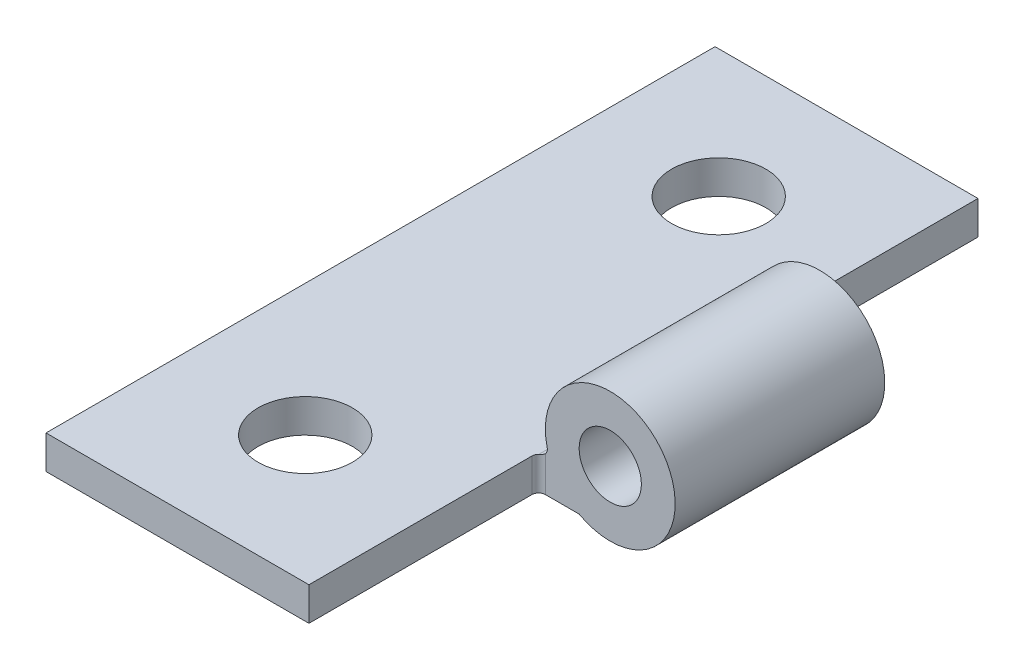
ISO-10303-21;
HEADER;
FILE_DESCRIPTION(('STEP AP214'),'2;1');
FILE_NAME('part.step','',(''),(''),'','','');
FILE_SCHEMA(('AUTOMOTIVE_DESIGN { 1 0 10303 214 1 1 1 1 }'));
ENDSEC;
DATA;
#1=APPLICATION_CONTEXT('core data for automotive mechanical design processes');
#2=APPLICATION_PROTOCOL_DEFINITION('international standard','automotive_design',2000,#1);
#3=PRODUCT_CONTEXT('',#1,'mechanical');
#4=PRODUCT('Part','Part','',(#3));
#5=PRODUCT_RELATED_PRODUCT_CATEGORY('part','',(#4));
#6=PRODUCT_DEFINITION_FORMATION('','',#4);
#7=PRODUCT_DEFINITION_CONTEXT('part definition',#1,'design');
#8=PRODUCT_DEFINITION('design','',#6,#7);
#9=PRODUCT_DEFINITION_SHAPE('','',#8);
#10=(LENGTH_UNIT() NAMED_UNIT(*) SI_UNIT(.MILLI.,.METRE.));
#11=(NAMED_UNIT(*) PLANE_ANGLE_UNIT() SI_UNIT($,.RADIAN.));
#12=(NAMED_UNIT(*) SI_UNIT($,.STERADIAN.) SOLID_ANGLE_UNIT());
#13=UNCERTAINTY_MEASURE_WITH_UNIT(LENGTH_MEASURE(1.E-05),#10,'distance_accuracy_value','');
#14=(GEOMETRIC_REPRESENTATION_CONTEXT(3) GLOBAL_UNCERTAINTY_ASSIGNED_CONTEXT((#13)) GLOBAL_UNIT_ASSIGNED_CONTEXT((#10,
#11,#12)) REPRESENTATION_CONTEXT('',''));
#15=CARTESIAN_POINT('',(0.,0.,0.));
#16=DIRECTION('',(0.,0.,1.));
#17=DIRECTION('',(1.,0.,0.));
#18=AXIS2_PLACEMENT_3D('',#15,#16,#17);
#19=CARTESIAN_POINT('',(-7.56939432776208,4.1385763680781,25.4));
#20=DIRECTION('',(0.,0.,-1.));
#21=DIRECTION('',(-1.,0.,0.));
#22=AXIS2_PLACEMENT_3D('',#19,#20,#21);
#23=CYLINDRICAL_SURFACE('',#22,0.254);
#24=DIRECTION('',(0.,0.,1.));
#25=VECTOR('',#24,1.);
#26=CARTESIAN_POINT('',(-7.56939432776208,3.8845763680781,0.));
#27=LINE('',#26,#25);
#28=CARTESIAN_POINT('',(-7.56939432776208,3.8845763680781,16.7517084015398));
#29=VERTEX_POINT('',#28);
#30=CARTESIAN_POINT('',(-7.56939432776208,3.8845763680781,8.64829159846018));
#31=VERTEX_POINT('',#30);
#32=EDGE_CURVE('E52',#29,#31,#27,.F.);
#33=ORIENTED_EDGE('',*,*,#32,.F.);
#34=CARTESIAN_POINT('',(-7.56939432776208,3.8845763680781,16.7517084015398));
#35=CARTESIAN_POINT('',(-7.56135668745851,3.88456692801648,16.7437883049521));
#36=CARTESIAN_POINT('',(-7.55275337596611,3.88495780348265,16.7364149583661));
#37=CARTESIAN_POINT('',(-7.53471275338375,3.88679410637373,16.7229046807157));
#38=CARTESIAN_POINT('',(-7.52527433420336,3.88824095396449,16.7167694289506));
#39=CARTESIAN_POINT('',(-7.50584259238112,3.89245352537904,16.705877117358));
#40=CARTESIAN_POINT('',(-7.49584706377318,3.89522487817183,16.7011260802788));
#41=CARTESIAN_POINT('',(-7.47579100856352,3.90221473178685,16.6930964397848));
#42=CARTESIAN_POINT('',(-7.46573061286791,3.90643089027619,16.6898154728223));
#43=CARTESIAN_POINT('',(-7.44652207839989,3.91602875812045,16.6847751638258));
#44=CARTESIAN_POINT('',(-7.43735426580634,3.92133305093389,16.6829416610186));
#45=CARTESIAN_POINT('',(-7.41966059402174,3.93312886665447,16.6803286849135));
#46=CARTESIAN_POINT('',(-7.41113465987094,3.93962025062638,16.6795490883577));
#47=CARTESIAN_POINT('',(-7.39905284901864,3.95008730971583,16.6789935002285));
#48=CARTESIAN_POINT('',(-7.39516602610554,3.95367284553677,16.6789092332638));
#49=CARTESIAN_POINT('',(-7.3914,3.95737476961791,16.67891));
#50=B_SPLINE_CURVE_WITH_KNOTS('',3,(#34,#35,#36,#37,#38,#39,#40,#41,#42,#43,#44,#45,#46,#47,#48,
#49),.UNSPECIFIED.,.F.,.F.,(4,2,2,2,2,2,2,4),(0.,0.0338498974036393,0.0677454032647584,
0.101786259043816,0.135772186520257,0.16787727227293,0.19997860290024,0.215828269392702),.UNSPECIFIED.);
#51=CARTESIAN_POINT('',(-7.3914,3.95737476961791,16.67891));
#52=VERTEX_POINT('',#51);
#53=EDGE_CURVE('E181',#29,#52,#50,.T.);
#54=ORIENTED_EDGE('',*,*,#53,.T.);
#55=CARTESIAN_POINT('',(-7.56939432776208,4.1385763680781,16.67891));
#56=DIRECTION('',(0.,0.,-1.));
#57=DIRECTION('',(-1.,0.,0.));
#58=AXIS2_PLACEMENT_3D('',#55,#56,#57);
#59=CIRCLE('',#58,0.254);
#60=CARTESIAN_POINT('',(-7.32249766161609,4.19822564507284,16.67891));
#61=VERTEX_POINT('',#60);
#62=EDGE_CURVE('E127',#52,#61,#59,.F.);
#63=ORIENTED_EDGE('',*,*,#62,.T.);
#64=DIRECTION('',(0.,0.,-1.));
#65=VECTOR('',#64,1.);
#66=CARTESIAN_POINT('',(-7.32249766161609,4.19822564507284,25.4));
#67=LINE('',#66,#65);
#68=CARTESIAN_POINT('',(-7.32249766161609,4.19822564507284,8.72109));
#69=VERTEX_POINT('',#68);
#70=EDGE_CURVE('E167',#69,#61,#67,.F.);
#71=ORIENTED_EDGE('',*,*,#70,.F.);
#72=CARTESIAN_POINT('',(-7.56939432776208,4.1385763680781,8.72109));
#73=DIRECTION('',(0.,0.,-1.));
#74=DIRECTION('',(-1.,0.,0.));
#75=AXIS2_PLACEMENT_3D('',#72,#73,#74);
#76=CIRCLE('',#75,0.254);
#77=CARTESIAN_POINT('',(-7.3914,3.95737476961791,8.72109));
#78=VERTEX_POINT('',#77);
#79=EDGE_CURVE('E242',#78,#69,#76,.F.);
#80=ORIENTED_EDGE('',*,*,#79,.F.);
#81=CARTESIAN_POINT('',(-7.3914,3.95737476961791,8.72109));
#82=CARTESIAN_POINT('',(-7.39943764030357,3.94945467303018,8.72109944006161));
#83=CARTESIAN_POINT('',(-7.40804095179597,3.9420813264442,8.72070856459545));
#84=CARTESIAN_POINT('',(-7.42608157437833,3.92857104879381,8.71887226170437));
#85=CARTESIAN_POINT('',(-7.43551999355872,3.92243579702871,8.7174254141136));
#86=CARTESIAN_POINT('',(-7.45495173538096,3.91154348543606,8.71321284269906));
#87=CARTESIAN_POINT('',(-7.4649472639889,3.90679244835687,8.71044148990626));
#88=CARTESIAN_POINT('',(-7.48500331919856,3.89876280786291,8.70345163629124));
#89=CARTESIAN_POINT('',(-7.49506371489417,3.89548184090043,8.6992354778019));
#90=CARTESIAN_POINT('',(-7.51427224936219,3.89044153190394,8.68963760995764));
#91=CARTESIAN_POINT('',(-7.52344006195574,3.88860802909672,8.6843333171442));
#92=CARTESIAN_POINT('',(-7.54113373374034,3.88599505299161,8.67253750142362));
#93=CARTESIAN_POINT('',(-7.54965966789114,3.88521545643575,8.66604611745171));
#94=CARTESIAN_POINT('',(-7.56174147874344,3.88465986830663,8.65557905836226));
#95=CARTESIAN_POINT('',(-7.56562830165654,3.88457560134187,8.65199352254132));
#96=CARTESIAN_POINT('',(-7.56939432776208,3.8845763680781,8.64829159846018));
#97=B_SPLINE_CURVE_WITH_KNOTS('',3,(#81,#82,#83,#84,#85,#86,#87,#88,#89,#90,#91,#92,#93,#94,#95,
#96),.UNSPECIFIED.,.F.,.F.,(4,2,2,2,2,2,2,4),(0.,0.0338498974036388,0.0677454032647585,
0.101786259043815,0.135772186520258,0.16787727227293,0.199978602900239,0.215828269392703),.UNSPECIFIED.);
#98=EDGE_CURVE('E219',#78,#31,#97,.T.);
#99=ORIENTED_EDGE('',*,*,#98,.T.);
#100=EDGE_LOOP('',(#33,#54,#63,#71,#80,#99));
#101=FACE_BOUND('',#100,.T.);
#102=ADVANCED_FACE('F36',(#101),#23,.F.);
#103=CARTESIAN_POINT('',(-4.9276,4.7768236319219,25.4));
#104=DIRECTION('',(0.,0.,-1.));
#105=DIRECTION('',(-1.,0.,0.));
#106=AXIS2_PLACEMENT_3D('',#103,#104,#105);
#107=CYLINDRICAL_SURFACE('',#106,2.4638);
#108=CARTESIAN_POINT('',(-4.9276,4.7768236319219,16.67891));
#109=DIRECTION('',(0.,0.,1.));
#110=DIRECTION('',(1.,0.,0.));
#111=AXIS2_PLACEMENT_3D('',#108,#109,#110);
#112=CIRCLE('',#111,2.4638);
#113=CARTESIAN_POINT('',(-6.1087,2.6145763680781,16.67891));
#114=VERTEX_POINT('',#113);
#115=EDGE_CURVE('E244',#114,#61,#112,.T.);
#116=ORIENTED_EDGE('',*,*,#115,.F.);
#117=DIRECTION('',(0.,0.,-1.));
#118=VECTOR('',#117,1.);
#119=CARTESIAN_POINT('',(-6.1087,2.6145763680781,25.4));
#120=LINE('',#119,#118);
#121=CARTESIAN_POINT('',(-6.1087,2.6145763680781,8.72109));
#122=VERTEX_POINT('',#121);
#123=EDGE_CURVE('E163',#114,#122,#120,.T.);
#124=ORIENTED_EDGE('',*,*,#123,.T.);
#125=CARTESIAN_POINT('',(-4.9276,4.7768236319219,8.72109));
#126=DIRECTION('',(0.,0.,-1.));
#127=DIRECTION('',(-1.,0.,0.));
#128=AXIS2_PLACEMENT_3D('',#125,#126,#127);
#129=CIRCLE('',#128,2.4638);
#130=EDGE_CURVE('E248',#69,#122,#129,.T.);
#131=ORIENTED_EDGE('',*,*,#130,.F.);
#132=ORIENTED_EDGE('',*,*,#70,.T.);
#133=EDGE_LOOP('',(#116,#124,#131,#132));
#134=FACE_BOUND('',#133,.T.);
#135=ADVANCED_FACE('F207',(#134),#107,.T.);
#136=CARTESIAN_POINT('',(-4.9276,4.7768236319219,25.4));
#137=DIRECTION('',(0.,0.,-1.));
#138=DIRECTION('',(-1.,0.,0.));
#139=AXIS2_PLACEMENT_3D('',#136,#137,#138);
#140=CYLINDRICAL_SURFACE('',#139,1.1811);
#141=CARTESIAN_POINT('',(-4.9276,4.7768236319219,8.72109));
#142=DIRECTION('',(0.,0.,-1.));
#143=DIRECTION('',(-1.,0.,0.));
#144=AXIS2_PLACEMENT_3D('',#141,#142,#143);
#145=CIRCLE('',#144,1.1811);
#146=CARTESIAN_POINT('',(-6.1087,4.7768236319219,8.72109));
#147=VERTEX_POINT('',#146);
#148=EDGE_CURVE('E150',#147,#147,#145,.T.);
#149=ORIENTED_EDGE('',*,*,#148,.T.);
#150=EDGE_LOOP('',(#149));
#151=FACE_BOUND('',#150,.T.);
#152=CARTESIAN_POINT('',(-4.9276,4.7768236319219,16.67891));
#153=DIRECTION('',(0.,0.,1.));
#154=DIRECTION('',(1.,0.,0.));
#155=AXIS2_PLACEMENT_3D('',#152,#153,#154);
#156=CIRCLE('',#155,1.1811);
#157=CARTESIAN_POINT('',(-3.7465,4.7768236319219,16.67891));
#158=VERTEX_POINT('',#157);
#159=EDGE_CURVE('E246',#158,#158,#156,.T.);
#160=ORIENTED_EDGE('',*,*,#159,.T.);
#161=EDGE_LOOP('',(#160));
#162=FACE_BOUND('',#161,.T.);
#163=ADVANCED_FACE('F213',(#151,#162),#140,.F.);
#164=CARTESIAN_POINT('',(-4.9276,4.7768236319219,25.4));
#165=DIRECTION('',(0.,0.,1.));
#166=DIRECTION('',(1.,0.,0.));
#167=AXIS2_PLACEMENT_3D('',#164,#165,#166);
#168=PLANE('',#167);
#169=DIRECTION('',(0.,-1.,0.));
#170=VECTOR('',#169,1.);
#171=CARTESIAN_POINT('',(-7.6454,2.61457636807809,25.4));
#172=LINE('',#171,#170);
#173=CARTESIAN_POINT('',(-7.6454,3.8845763680781,25.4));
#174=VERTEX_POINT('',#173);
#175=CARTESIAN_POINT('',(-7.6454,2.61457636807809,25.4));
#176=VERTEX_POINT('',#175);
#177=EDGE_CURVE('E131',#174,#176,#172,.T.);
#178=ORIENTED_EDGE('',*,*,#177,.F.);
#179=DIRECTION('',(-1.,0.,0.));
#180=VECTOR('',#179,1.);
#181=CARTESIAN_POINT('',(-17.6276,3.88457636807809,25.4));
#182=LINE('',#181,#180);
#183=CARTESIAN_POINT('',(-17.6276,3.88457636807809,25.4));
#184=VERTEX_POINT('',#183);
#185=EDGE_CURVE('E143',#174,#184,#182,.T.);
#186=ORIENTED_EDGE('',*,*,#185,.T.);
#187=DIRECTION('',(0.,-1.,0.));
#188=VECTOR('',#187,1.);
#189=CARTESIAN_POINT('',(-17.6276,2.61457636807809,25.4));
#190=LINE('',#189,#188);
#191=CARTESIAN_POINT('',(-17.6276,2.61457636807809,25.4));
#192=VERTEX_POINT('',#191);
#193=EDGE_CURVE('E141',#184,#192,#190,.T.);
#194=ORIENTED_EDGE('',*,*,#193,.T.);
#195=DIRECTION('',(1.,0.,0.));
#196=VECTOR('',#195,1.);
#197=CARTESIAN_POINT('',(-17.6276,2.61457636807809,25.4));
#198=LINE('',#197,#196);
#199=EDGE_CURVE('E123',#192,#176,#198,.T.);
#200=ORIENTED_EDGE('',*,*,#199,.T.);
#201=EDGE_LOOP('',(#178,#186,#194,#200));
#202=FACE_BOUND('',#201,.T.);
#203=ADVANCED_FACE('F139',(#202),#168,.T.);
#204=CARTESIAN_POINT('',(-4.9276,4.7768236319219,0.));
#205=DIRECTION('',(0.,0.,1.));
#206=DIRECTION('',(1.,0.,0.));
#207=AXIS2_PLACEMENT_3D('',#204,#205,#206);
#208=PLANE('',#207);
#209=DIRECTION('',(-1.,0.,0.));
#210=VECTOR('',#209,1.);
#211=CARTESIAN_POINT('',(-17.6276,3.88457636807809,0.));
#212=LINE('',#211,#210);
#213=CARTESIAN_POINT('',(-7.6454,3.8845763680781,0.));
#214=VERTEX_POINT('',#213);
#215=CARTESIAN_POINT('',(-17.6276,3.88457636807809,0.));
#216=VERTEX_POINT('',#215);
#217=EDGE_CURVE('E147',#214,#216,#212,.T.);
#218=ORIENTED_EDGE('',*,*,#217,.F.);
#219=DIRECTION('',(0.,1.,0.));
#220=VECTOR('',#219,1.);
#221=CARTESIAN_POINT('',(-7.6454,2.61457636807809,0.));
#222=LINE('',#221,#220);
#223=CARTESIAN_POINT('',(-7.6454,2.61457636807809,0.));
#224=VERTEX_POINT('',#223);
#225=EDGE_CURVE('E234',#224,#214,#222,.T.);
#226=ORIENTED_EDGE('',*,*,#225,.F.);
#227=DIRECTION('',(1.,0.,0.));
#228=VECTOR('',#227,1.);
#229=CARTESIAN_POINT('',(-17.6276,2.61457636807809,0.));
#230=LINE('',#229,#228);
#231=CARTESIAN_POINT('',(-17.6276,2.61457636807809,0.));
#232=VERTEX_POINT('',#231);
#233=EDGE_CURVE('E155',#232,#224,#230,.T.);
#234=ORIENTED_EDGE('',*,*,#233,.F.);
#235=DIRECTION('',(0.,-1.,0.));
#236=VECTOR('',#235,1.);
#237=CARTESIAN_POINT('',(-17.6276,2.61457636807809,0.));
#238=LINE('',#237,#236);
#239=EDGE_CURVE('E144',#216,#232,#238,.T.);
#240=ORIENTED_EDGE('',*,*,#239,.F.);
#241=EDGE_LOOP('',(#218,#226,#234,#240));
#242=FACE_BOUND('',#241,.T.);
#243=ADVANCED_FACE('F273',(#242),#208,.F.);
#244=CARTESIAN_POINT('',(-17.6276,2.61457636807809,25.4));
#245=DIRECTION('',(0.,1.,0.));
#246=DIRECTION('',(-1.,0.,0.));
#247=AXIS2_PLACEMENT_3D('',#244,#245,#246);
#248=PLANE('',#247);
#249=CARTESIAN_POINT('',(-12.6365,2.61457636807809,4.8514));
#250=DIRECTION('',(0.,1.,0.));
#251=DIRECTION('',(-1.,0.,0.));
#252=AXIS2_PLACEMENT_3D('',#249,#250,#251);
#253=CIRCLE('',#252,1.7907);
#254=CARTESIAN_POINT('',(-14.4272,2.61457636807809,4.8514));
#255=VERTEX_POINT('',#254);
#256=EDGE_CURVE('E137',#255,#255,#253,.T.);
#257=ORIENTED_EDGE('',*,*,#256,.T.);
#258=EDGE_LOOP('',(#257));
#259=FACE_BOUND('',#258,.T.);
#260=CARTESIAN_POINT('',(-12.6365,2.61457636807809,20.5486));
#261=DIRECTION('',(0.,1.,0.));
#262=DIRECTION('',(-1.,0.,0.));
#263=AXIS2_PLACEMENT_3D('',#260,#261,#262);
#264=CIRCLE('',#263,1.7907);
#265=CARTESIAN_POINT('',(-14.4272,2.61457636807809,20.5486));
#266=VERTEX_POINT('',#265);
#267=EDGE_CURVE('E289',#266,#266,#264,.T.);
#268=ORIENTED_EDGE('',*,*,#267,.T.);
#269=EDGE_LOOP('',(#268));
#270=FACE_BOUND('',#269,.T.);
#271=DIRECTION('',(1.,0.,0.));
#272=VECTOR('',#271,1.);
#273=CARTESIAN_POINT('',(-7.6454,2.61457636807809,16.67891));
#274=LINE('',#273,#272);
#275=CARTESIAN_POINT('',(-7.3914,2.61457636807809,16.67891));
#276=VERTEX_POINT('',#275);
#277=EDGE_CURVE('E128',#276,#114,#274,.T.);
#278=ORIENTED_EDGE('',*,*,#277,.F.);
#279=CARTESIAN_POINT('',(-7.3914,2.6145763680781,16.93291));
#280=DIRECTION('',(0.,1.,0.));
#281=DIRECTION('',(-1.,0.,0.));
#282=AXIS2_PLACEMENT_3D('',#279,#280,#281);
#283=CIRCLE('',#282,0.254);
#284=CARTESIAN_POINT('',(-7.6454,2.61457636807809,16.93291));
#285=VERTEX_POINT('',#284);
#286=EDGE_CURVE('E124',#276,#285,#283,.T.);
#287=ORIENTED_EDGE('',*,*,#286,.T.);
#288=DIRECTION('',(0.,0.,1.));
#289=VECTOR('',#288,1.);
#290=CARTESIAN_POINT('',(-7.6454,2.61457636807809,16.67891));
#291=LINE('',#290,#289);
#292=EDGE_CURVE('E117',#285,#176,#291,.T.);
#293=ORIENTED_EDGE('',*,*,#292,.T.);
#294=ORIENTED_EDGE('',*,*,#199,.F.);
#295=DIRECTION('',(0.,0.,-1.));
#296=VECTOR('',#295,1.);
#297=CARTESIAN_POINT('',(-17.6276,2.61457636807809,25.4));
#298=LINE('',#297,#296);
#299=EDGE_CURVE('E154',#192,#232,#298,.T.);
#300=ORIENTED_EDGE('',*,*,#299,.T.);
#301=ORIENTED_EDGE('',*,*,#233,.T.);
#302=DIRECTION('',(0.,0.,-1.));
#303=VECTOR('',#302,1.);
#304=CARTESIAN_POINT('',(-7.6454,2.61457636807809,8.72109));
#305=LINE('',#304,#303);
#306=CARTESIAN_POINT('',(-7.6454,2.61457636807809,8.46709));
#307=VERTEX_POINT('',#306);
#308=EDGE_CURVE('E238',#307,#224,#305,.T.);
#309=ORIENTED_EDGE('',*,*,#308,.F.);
#310=CARTESIAN_POINT('',(-7.3914,2.6145763680781,8.46709));
#311=DIRECTION('',(0.,1.,0.));
#312=DIRECTION('',(-1.,0.,0.));
#313=AXIS2_PLACEMENT_3D('',#310,#311,#312);
#314=CIRCLE('',#313,0.254);
#315=CARTESIAN_POINT('',(-7.3914,2.61457636807809,8.72109));
#316=VERTEX_POINT('',#315);
#317=EDGE_CURVE('E11',#307,#316,#314,.T.);
#318=ORIENTED_EDGE('',*,*,#317,.T.);
#319=DIRECTION('',(-1.,0.,0.));
#320=VECTOR('',#319,1.);
#321=CARTESIAN_POINT('',(-7.6454,2.61457636807809,8.72109));
#322=LINE('',#321,#320);
#323=EDGE_CURVE('E235',#122,#316,#322,.T.);
#324=ORIENTED_EDGE('',*,*,#323,.F.);
#325=ORIENTED_EDGE('',*,*,#123,.F.);
#326=EDGE_LOOP('',(#278,#287,#293,#294,#300,#301,#309,#318,#324,#325));
#327=FACE_BOUND('',#326,.T.);
#328=ADVANCED_FACE('F120',(#259,#270,#327),#248,.F.);
#329=CARTESIAN_POINT('',(-17.6276,3.88457636807809,25.4));
#330=DIRECTION('',(0.,-1.,0.));
#331=DIRECTION('',(1.,0.,0.));
#332=AXIS2_PLACEMENT_3D('',#329,#330,#331);
#333=PLANE('',#332);
#334=CARTESIAN_POINT('',(-12.6365,3.88457636807809,4.8514));
#335=DIRECTION('',(0.,1.,0.));
#336=DIRECTION('',(-1.,0.,0.));
#337=AXIS2_PLACEMENT_3D('',#334,#335,#336);
#338=CIRCLE('',#337,1.7907);
#339=CARTESIAN_POINT('',(-14.4272,3.88457636807809,4.8514));
#340=VERTEX_POINT('',#339);
#341=EDGE_CURVE('E291',#340,#340,#338,.T.);
#342=ORIENTED_EDGE('',*,*,#341,.F.);
#343=EDGE_LOOP('',(#342));
#344=FACE_BOUND('',#343,.T.);
#345=CARTESIAN_POINT('',(-12.6365,3.88457636807809,20.5486));
#346=DIRECTION('',(0.,1.,0.));
#347=DIRECTION('',(-1.,0.,0.));
#348=AXIS2_PLACEMENT_3D('',#345,#346,#347);
#349=CIRCLE('',#348,1.7907);
#350=CARTESIAN_POINT('',(-14.4272,3.88457636807809,20.5486));
#351=VERTEX_POINT('',#350);
#352=EDGE_CURVE('E293',#351,#351,#349,.T.);
#353=ORIENTED_EDGE('',*,*,#352,.F.);
#354=EDGE_LOOP('',(#353));
#355=FACE_BOUND('',#354,.T.);
#356=ORIENTED_EDGE('',*,*,#185,.F.);
#357=DIRECTION('',(0.,0.,-1.));
#358=VECTOR('',#357,1.);
#359=CARTESIAN_POINT('',(-7.6454,3.8845763680781,25.4));
#360=LINE('',#359,#358);
#361=CARTESIAN_POINT('',(-7.6454,3.8845763680781,16.93291));
#362=VERTEX_POINT('',#361);
#363=EDGE_CURVE('E134',#174,#362,#360,.T.);
#364=ORIENTED_EDGE('',*,*,#363,.T.);
#365=CARTESIAN_POINT('',(-7.3914,3.8845763680781,16.93291));
#366=DIRECTION('',(0.,-1.,0.));
#367=DIRECTION('',(1.,0.,0.));
#368=AXIS2_PLACEMENT_3D('',#365,#366,#367);
#369=CIRCLE('',#368,0.254);
#370=EDGE_CURVE('E179',#362,#29,#369,.T.);
#371=ORIENTED_EDGE('',*,*,#370,.T.);
#372=ORIENTED_EDGE('',*,*,#32,.T.);
#373=CARTESIAN_POINT('',(-7.3914,3.8845763680781,8.46709));
#374=DIRECTION('',(0.,-1.,0.));
#375=DIRECTION('',(1.,0.,0.));
#376=AXIS2_PLACEMENT_3D('',#373,#374,#375);
#377=CIRCLE('',#376,0.254);
#378=CARTESIAN_POINT('',(-7.6454,3.8845763680781,8.46709));
#379=VERTEX_POINT('',#378);
#380=EDGE_CURVE('E45',#31,#379,#377,.T.);
#381=ORIENTED_EDGE('',*,*,#380,.T.);
#382=DIRECTION('',(0.,0.,-1.));
#383=VECTOR('',#382,1.);
#384=CARTESIAN_POINT('',(-7.6454,3.8845763680781,25.4));
#385=LINE('',#384,#383);
#386=EDGE_CURVE('E170',#379,#214,#385,.T.);
#387=ORIENTED_EDGE('',*,*,#386,.T.);
#388=ORIENTED_EDGE('',*,*,#217,.T.);
#389=DIRECTION('',(0.,0.,-1.));
#390=VECTOR('',#389,1.);
#391=CARTESIAN_POINT('',(-17.6276,3.88457636807809,25.4));
#392=LINE('',#391,#390);
#393=EDGE_CURVE('E160',#184,#216,#392,.T.);
#394=ORIENTED_EDGE('',*,*,#393,.F.);
#395=EDGE_LOOP('',(#356,#364,#371,#372,#381,#387,#388,#394));
#396=FACE_BOUND('',#395,.T.);
#397=ADVANCED_FACE('F220',(#344,#355,#396),#333,.F.);
#398=CARTESIAN_POINT('',(-17.6276,2.61457636807809,25.4));
#399=DIRECTION('',(1.,0.,0.));
#400=DIRECTION('',(0.,0.,-1.));
#401=AXIS2_PLACEMENT_3D('',#398,#399,#400);
#402=PLANE('',#401);
#403=ORIENTED_EDGE('',*,*,#239,.T.);
#404=ORIENTED_EDGE('',*,*,#299,.F.);
#405=ORIENTED_EDGE('',*,*,#193,.F.);
#406=ORIENTED_EDGE('',*,*,#393,.T.);
#407=EDGE_LOOP('',(#403,#404,#405,#406));
#408=FACE_BOUND('',#407,.T.);
#409=ADVANCED_FACE('F257',(#408),#402,.F.);
#410=CARTESIAN_POINT('',(-4.9276,4.7768236319219,8.72109));
#411=DIRECTION('',(0.,0.,-1.));
#412=DIRECTION('',(-1.,0.,0.));
#413=AXIS2_PLACEMENT_3D('',#410,#411,#412);
#414=PLANE('',#413);
#415=ORIENTED_EDGE('',*,*,#323,.T.);
#416=DIRECTION('',(0.,1.,0.));
#417=VECTOR('',#416,1.);
#418=CARTESIAN_POINT('',(-7.3914,4.7768236319219,8.72109));
#419=LINE('',#418,#417);
#420=EDGE_CURVE('E188',#316,#78,#419,.T.);
#421=ORIENTED_EDGE('',*,*,#420,.T.);
#422=ORIENTED_EDGE('',*,*,#79,.T.);
#423=ORIENTED_EDGE('',*,*,#130,.T.);
#424=EDGE_LOOP('',(#415,#421,#422,#423));
#425=FACE_BOUND('',#424,.T.);
#426=ORIENTED_EDGE('',*,*,#148,.F.);
#427=EDGE_LOOP('',(#426));
#428=FACE_BOUND('',#427,.T.);
#429=ADVANCED_FACE('F256',(#425,#428),#414,.T.);
#430=CARTESIAN_POINT('',(-4.9276,4.7768236319219,16.67891));
#431=DIRECTION('',(0.,0.,1.));
#432=DIRECTION('',(1.,0.,0.));
#433=AXIS2_PLACEMENT_3D('',#430,#431,#432);
#434=PLANE('',#433);
#435=ORIENTED_EDGE('',*,*,#62,.F.);
#436=DIRECTION('',(0.,-1.,0.));
#437=VECTOR('',#436,1.);
#438=CARTESIAN_POINT('',(-7.3914,4.7768236319219,16.67891));
#439=LINE('',#438,#437);
#440=EDGE_CURVE('E173',#52,#276,#439,.T.);
#441=ORIENTED_EDGE('',*,*,#440,.T.);
#442=ORIENTED_EDGE('',*,*,#277,.T.);
#443=ORIENTED_EDGE('',*,*,#115,.T.);
#444=EDGE_LOOP('',(#435,#441,#442,#443));
#445=FACE_BOUND('',#444,.T.);
#446=ORIENTED_EDGE('',*,*,#159,.F.);
#447=EDGE_LOOP('',(#446));
#448=FACE_BOUND('',#447,.T.);
#449=ADVANCED_FACE('F223',(#445,#448),#434,.T.);
#450=CARTESIAN_POINT('',(-7.6454,2.61457636807809,8.72109));
#451=DIRECTION('',(-1.,0.,0.));
#452=DIRECTION('',(0.,-1.,0.));
#453=AXIS2_PLACEMENT_3D('',#450,#451,#452);
#454=PLANE('',#453);
#455=ORIENTED_EDGE('',*,*,#386,.F.);
#456=DIRECTION('',(0.,1.,0.));
#457=VECTOR('',#456,1.);
#458=CARTESIAN_POINT('',(-7.6454,2.61457636807809,8.46709));
#459=LINE('',#458,#457);
#460=EDGE_CURVE('E312',#379,#307,#459,.F.);
#461=ORIENTED_EDGE('',*,*,#460,.T.);
#462=ORIENTED_EDGE('',*,*,#308,.T.);
#463=ORIENTED_EDGE('',*,*,#225,.T.);
#464=EDGE_LOOP('',(#455,#461,#462,#463));
#465=FACE_BOUND('',#464,.T.);
#466=ADVANCED_FACE('F203',(#465),#454,.F.);
#467=CARTESIAN_POINT('',(-7.6454,2.61457636807809,16.67891));
#468=DIRECTION('',(-1.,0.,0.));
#469=DIRECTION('',(0.,0.,1.));
#470=AXIS2_PLACEMENT_3D('',#467,#468,#469);
#471=PLANE('',#470);
#472=ORIENTED_EDGE('',*,*,#292,.F.);
#473=DIRECTION('',(0.,-1.,0.));
#474=VECTOR('',#473,1.);
#475=CARTESIAN_POINT('',(-7.6454,2.61457636807809,16.93291));
#476=LINE('',#475,#474);
#477=EDGE_CURVE('E176',#285,#362,#476,.F.);
#478=ORIENTED_EDGE('',*,*,#477,.T.);
#479=ORIENTED_EDGE('',*,*,#363,.F.);
#480=ORIENTED_EDGE('',*,*,#177,.T.);
#481=EDGE_LOOP('',(#472,#478,#479,#480));
#482=FACE_BOUND('',#481,.T.);
#483=ADVANCED_FACE('F132',(#482),#471,.F.);
#484=CARTESIAN_POINT('',(-7.3914,4.7768236319219,16.93291));
#485=DIRECTION('',(0.,-1.,0.));
#486=DIRECTION('',(0.,0.,-1.));
#487=AXIS2_PLACEMENT_3D('',#484,#485,#486);
#488=CYLINDRICAL_SURFACE('',#487,0.254);
#489=ORIENTED_EDGE('',*,*,#370,.F.);
#490=ORIENTED_EDGE('',*,*,#477,.F.);
#491=ORIENTED_EDGE('',*,*,#286,.F.);
#492=ORIENTED_EDGE('',*,*,#440,.F.);
#493=ORIENTED_EDGE('',*,*,#53,.F.);
#494=EDGE_LOOP('',(#489,#490,#491,#492,#493));
#495=FACE_BOUND('',#494,.T.);
#496=ADVANCED_FACE('F192',(#495),#488,.F.);
#497=CARTESIAN_POINT('',(-7.3914,4.7768236319219,8.46709));
#498=DIRECTION('',(0.,1.,0.));
#499=DIRECTION('',(-1.,0.,0.));
#500=AXIS2_PLACEMENT_3D('',#497,#498,#499);
#501=CYLINDRICAL_SURFACE('',#500,0.254);
#502=ORIENTED_EDGE('',*,*,#317,.F.);
#503=ORIENTED_EDGE('',*,*,#460,.F.);
#504=ORIENTED_EDGE('',*,*,#380,.F.);
#505=ORIENTED_EDGE('',*,*,#98,.F.);
#506=ORIENTED_EDGE('',*,*,#420,.F.);
#507=EDGE_LOOP('',(#502,#503,#504,#505,#506));
#508=FACE_BOUND('',#507,.T.);
#509=ADVANCED_FACE('F38',(#508),#501,.F.);
#510=CARTESIAN_POINT('',(-12.6365,1.34457636807809,20.5486));
#511=DIRECTION('',(0.,1.,0.));
#512=DIRECTION('',(-1.,0.,0.));
#513=AXIS2_PLACEMENT_3D('',#510,#511,#512);
#514=CYLINDRICAL_SURFACE('',#513,1.7907);
#515=ORIENTED_EDGE('',*,*,#352,.T.);
#516=EDGE_LOOP('',(#515));
#517=FACE_BOUND('',#516,.T.);
#518=ORIENTED_EDGE('',*,*,#267,.F.);
#519=EDGE_LOOP('',(#518));
#520=FACE_BOUND('',#519,.T.);
#521=ADVANCED_FACE('F200',(#517,#520),#514,.F.);
#522=CARTESIAN_POINT('',(-12.6365,1.34457636807809,4.8514));
#523=DIRECTION('',(0.,1.,0.));
#524=DIRECTION('',(-1.,0.,0.));
#525=AXIS2_PLACEMENT_3D('',#522,#523,#524);
#526=CYLINDRICAL_SURFACE('',#525,1.7907);
#527=ORIENTED_EDGE('',*,*,#341,.T.);
#528=EDGE_LOOP('',(#527));
#529=FACE_BOUND('',#528,.T.);
#530=ORIENTED_EDGE('',*,*,#256,.F.);
#531=EDGE_LOOP('',(#530));
#532=FACE_BOUND('',#531,.T.);
#533=ADVANCED_FACE('F301',(#529,#532),#526,.F.);
#534=CLOSED_SHELL('',(#102,#135,#163,#203,#243,#328,#397,#409,#429,#449,#466,#483,#496,#509,
#521,#533));
#535=MANIFOLD_SOLID_BREP('B2',#534);
#536=ADVANCED_BREP_SHAPE_REPRESENTATION('',(#18,#535),#14);
#537=SHAPE_DEFINITION_REPRESENTATION(#9,#536);
ENDSEC;
END-ISO-10303-21;
